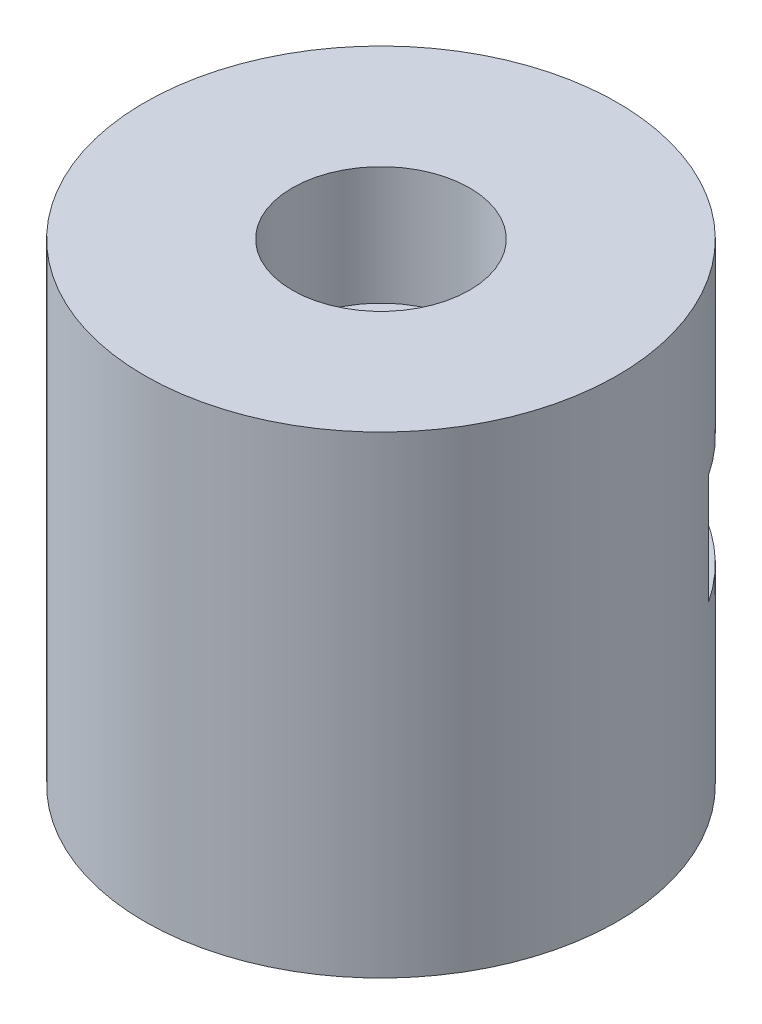
ISO-10303-21;
HEADER;
FILE_DESCRIPTION(('STEP AP214'),'2;1');
FILE_NAME('part.step','',(''),(''),'','','');
FILE_SCHEMA(('AUTOMOTIVE_DESIGN { 1 0 10303 214 1 1 1 1 }'));
ENDSEC;
DATA;
#1=APPLICATION_CONTEXT('core data for automotive mechanical design processes');
#2=APPLICATION_PROTOCOL_DEFINITION('international standard','automotive_design',2000,#1);
#3=PRODUCT_CONTEXT('',#1,'mechanical');
#4=PRODUCT('Part','Part','',(#3));
#5=PRODUCT_RELATED_PRODUCT_CATEGORY('part','',(#4));
#6=PRODUCT_DEFINITION_FORMATION('','',#4);
#7=PRODUCT_DEFINITION_CONTEXT('part definition',#1,'design');
#8=PRODUCT_DEFINITION('design','',#6,#7);
#9=PRODUCT_DEFINITION_SHAPE('','',#8);
#10=(LENGTH_UNIT() NAMED_UNIT(*) SI_UNIT(.MILLI.,.METRE.));
#11=(NAMED_UNIT(*) PLANE_ANGLE_UNIT() SI_UNIT($,.RADIAN.));
#12=(NAMED_UNIT(*) SI_UNIT($,.STERADIAN.) SOLID_ANGLE_UNIT());
#13=UNCERTAINTY_MEASURE_WITH_UNIT(LENGTH_MEASURE(1.E-05),#10,'distance_accuracy_value','');
#14=(GEOMETRIC_REPRESENTATION_CONTEXT(3) GLOBAL_UNCERTAINTY_ASSIGNED_CONTEXT((#13)) GLOBAL_UNIT_ASSIGNED_CONTEXT((#10,
#11,#12)) REPRESENTATION_CONTEXT('',''));
#15=CARTESIAN_POINT('',(0.,0.,0.));
#16=DIRECTION('',(0.,0.,1.));
#17=DIRECTION('',(1.,0.,0.));
#18=AXIS2_PLACEMENT_3D('',#15,#16,#17);
#19=CARTESIAN_POINT('',(0.,40.,0.));
#20=DIRECTION('',(0.,-1.,0.));
#21=DIRECTION('',(0.,0.,-1.));
#22=AXIS2_PLACEMENT_3D('',#19,#20,#21);
#23=CYLINDRICAL_SURFACE('',#22,20.);
#24=CARTESIAN_POINT('',(0.,40.,0.));
#25=DIRECTION('',(0.,1.,0.));
#26=DIRECTION('',(0.,0.,1.));
#27=AXIS2_PLACEMENT_3D('',#24,#25,#26);
#28=CIRCLE('',#27,20.);
#29=CARTESIAN_POINT('',(0.,40.,20.));
#30=VERTEX_POINT('',#29);
#31=EDGE_CURVE('E102',#30,#30,#28,.T.);
#32=ORIENTED_EDGE('',*,*,#31,.F.);
#33=EDGE_LOOP('',(#32));
#34=FACE_BOUND('',#33,.T.);
#35=CARTESIAN_POINT('',(0.,0.,0.));
#36=DIRECTION('',(0.,1.,0.));
#37=DIRECTION('',(0.,0.,1.));
#38=AXIS2_PLACEMENT_3D('',#35,#36,#37);
#39=CIRCLE('',#38,20.);
#40=CARTESIAN_POINT('',(0.,0.,20.));
#41=VERTEX_POINT('',#40);
#42=EDGE_CURVE('E100',#41,#41,#39,.T.);
#43=ORIENTED_EDGE('',*,*,#42,.T.);
#44=EDGE_LOOP('',(#43));
#45=FACE_BOUND('',#44,.T.);
#46=CARTESIAN_POINT('',(0.,16.2259243327284,0.));
#47=DIRECTION('',(0.,1.,0.));
#48=DIRECTION('',(0.,0.,1.));
#49=AXIS2_PLACEMENT_3D('',#46,#47,#48);
#50=CIRCLE('',#49,20.);
#51=CARTESIAN_POINT('',(16.7022923147358,16.2259243327284,-11.0015195056464));
#52=VERTEX_POINT('',#51);
#53=CARTESIAN_POINT('',(-16.7022923147358,16.2259243327284,-11.0015195056464));
#54=VERTEX_POINT('',#53);
#55=EDGE_CURVE('E56',#52,#54,#50,.T.);
#56=ORIENTED_EDGE('',*,*,#55,.F.);
#57=DIRECTION('',(0.,-1.,0.));
#58=VECTOR('',#57,1.);
#59=CARTESIAN_POINT('',(16.7022923147358,40.,-11.0015195056464));
#60=LINE('',#59,#58);
#61=CARTESIAN_POINT('',(16.7022923147358,25.5406642774849,-11.0015195056464));
#62=VERTEX_POINT('',#61);
#63=EDGE_CURVE('E11',#62,#52,#60,.T.);
#64=ORIENTED_EDGE('',*,*,#63,.F.);
#65=CARTESIAN_POINT('',(0.,25.5406642774849,0.));
#66=DIRECTION('',(0.,-1.,0.));
#67=DIRECTION('',(0.,0.,-1.));
#68=AXIS2_PLACEMENT_3D('',#65,#66,#67);
#69=CIRCLE('',#68,20.);
#70=CARTESIAN_POINT('',(-16.7022923147358,25.5406642774849,-11.0015195056464));
#71=VERTEX_POINT('',#70);
#72=EDGE_CURVE('E105',#71,#62,#69,.T.);
#73=ORIENTED_EDGE('',*,*,#72,.F.);
#74=DIRECTION('',(0.,-1.,0.));
#75=VECTOR('',#74,1.);
#76=CARTESIAN_POINT('',(-16.7022923147358,40.,-11.0015195056464));
#77=LINE('',#76,#75);
#78=EDGE_CURVE('E41',#54,#71,#77,.F.);
#79=ORIENTED_EDGE('',*,*,#78,.F.);
#80=EDGE_LOOP('',(#56,#64,#73,#79));
#81=FACE_BOUND('',#80,.T.);
#82=ADVANCED_FACE('F34',(#34,#45,#81),#23,.T.);
#83=CARTESIAN_POINT('',(0.,40.,0.));
#84=DIRECTION('',(0.,1.,0.));
#85=DIRECTION('',(0.,0.,1.));
#86=AXIS2_PLACEMENT_3D('',#83,#84,#85);
#87=PLANE('',#86);
#88=CARTESIAN_POINT('',(0.,40.,0.));
#89=DIRECTION('',(0.,1.,0.));
#90=DIRECTION('',(0.,0.,1.));
#91=AXIS2_PLACEMENT_3D('',#88,#89,#90);
#92=CIRCLE('',#91,7.5);
#93=CARTESIAN_POINT('',(0.,40.,7.5));
#94=VERTEX_POINT('',#93);
#95=EDGE_CURVE('E89',#94,#94,#92,.T.);
#96=ORIENTED_EDGE('',*,*,#95,.F.);
#97=EDGE_LOOP('',(#96));
#98=FACE_BOUND('',#97,.T.);
#99=ORIENTED_EDGE('',*,*,#31,.T.);
#100=EDGE_LOOP('',(#99));
#101=FACE_BOUND('',#100,.T.);
#102=ADVANCED_FACE('F130',(#98,#101),#87,.T.);
#103=CARTESIAN_POINT('',(0.,0.,0.));
#104=DIRECTION('',(0.,1.,0.));
#105=DIRECTION('',(0.,0.,1.));
#106=AXIS2_PLACEMENT_3D('',#103,#104,#105);
#107=PLANE('',#106);
#108=ORIENTED_EDGE('',*,*,#42,.F.);
#109=EDGE_LOOP('',(#108));
#110=FACE_BOUND('',#109,.T.);
#111=ADVANCED_FACE('F135',(#110),#107,.F.);
#112=CARTESIAN_POINT('',(0.,30.,0.));
#113=DIRECTION('',(0.,1.,0.));
#114=DIRECTION('',(0.,0.,1.));
#115=AXIS2_PLACEMENT_3D('',#112,#113,#114);
#116=CYLINDRICAL_SURFACE('',#115,7.5);
#117=CARTESIAN_POINT('',(0.,30.,0.));
#118=DIRECTION('',(0.,1.,0.));
#119=DIRECTION('',(0.,0.,1.));
#120=AXIS2_PLACEMENT_3D('',#117,#118,#119);
#121=CIRCLE('',#120,7.5);
#122=CARTESIAN_POINT('',(0.,30.,7.5));
#123=VERTEX_POINT('',#122);
#124=EDGE_CURVE('E93',#123,#123,#121,.T.);
#125=ORIENTED_EDGE('',*,*,#124,.F.);
#126=EDGE_LOOP('',(#125));
#127=FACE_BOUND('',#126,.T.);
#128=ORIENTED_EDGE('',*,*,#95,.T.);
#129=EDGE_LOOP('',(#128));
#130=FACE_BOUND('',#129,.T.);
#131=ADVANCED_FACE('F143',(#127,#130),#116,.F.);
#132=CARTESIAN_POINT('',(0.,30.,0.));
#133=DIRECTION('',(0.,1.,0.));
#134=DIRECTION('',(0.,0.,1.));
#135=AXIS2_PLACEMENT_3D('',#132,#133,#134);
#136=PLANE('',#135);
#137=ORIENTED_EDGE('',*,*,#124,.T.);
#138=EDGE_LOOP('',(#137));
#139=FACE_BOUND('',#138,.T.);
#140=ADVANCED_FACE('F147',(#139),#136,.T.);
#141=CARTESIAN_POINT('',(-16.7022923147358,25.5406642774849,-10.));
#142=DIRECTION('',(1.,0.,0.));
#143=DIRECTION('',(0.,0.,-1.));
#144=AXIS2_PLACEMENT_3D('',#141,#142,#143);
#145=PLANE('',#144);
#146=ORIENTED_EDGE('',*,*,#78,.T.);
#147=DIRECTION('',(0.,0.,-1.));
#148=VECTOR('',#147,1.);
#149=CARTESIAN_POINT('',(-16.7022923147358,25.5406642774849,-10.));
#150=LINE('',#149,#148);
#151=CARTESIAN_POINT('',(-16.7022923147358,25.5406642774849,-10.));
#152=VERTEX_POINT('',#151);
#153=EDGE_CURVE('E48',#152,#71,#150,.T.);
#154=ORIENTED_EDGE('',*,*,#153,.F.);
#155=DIRECTION('',(0.,-1.,0.));
#156=VECTOR('',#155,1.);
#157=CARTESIAN_POINT('',(-16.7022923147358,25.5406642774849,-10.));
#158=LINE('',#157,#156);
#159=CARTESIAN_POINT('',(-16.7022923147358,16.2259243327284,-10.));
#160=VERTEX_POINT('',#159);
#161=EDGE_CURVE('E79',#152,#160,#158,.T.);
#162=ORIENTED_EDGE('',*,*,#161,.T.);
#163=DIRECTION('',(0.,0.,-1.));
#164=VECTOR('',#163,1.);
#165=CARTESIAN_POINT('',(-16.7022923147358,16.2259243327284,-10.));
#166=LINE('',#165,#164);
#167=EDGE_CURVE('E85',#160,#54,#166,.T.);
#168=ORIENTED_EDGE('',*,*,#167,.T.);
#169=EDGE_LOOP('',(#146,#154,#162,#168));
#170=FACE_BOUND('',#169,.T.);
#171=ADVANCED_FACE('F84',(#170),#145,.T.);
#172=CARTESIAN_POINT('',(16.7022923147358,16.2259243327284,-10.));
#173=DIRECTION('',(0.,1.,0.));
#174=DIRECTION('',(0.,0.,1.));
#175=AXIS2_PLACEMENT_3D('',#172,#173,#174);
#176=PLANE('',#175);
#177=DIRECTION('',(0.,0.,-1.));
#178=VECTOR('',#177,1.);
#179=CARTESIAN_POINT('',(16.7022923147358,16.2259243327284,-10.));
#180=LINE('',#179,#178);
#181=CARTESIAN_POINT('',(16.7022923147358,16.2259243327284,-10.));
#182=VERTEX_POINT('',#181);
#183=EDGE_CURVE('E90',#182,#52,#180,.T.);
#184=ORIENTED_EDGE('',*,*,#183,.T.);
#185=ORIENTED_EDGE('',*,*,#55,.T.);
#186=ORIENTED_EDGE('',*,*,#167,.F.);
#187=DIRECTION('',(1.,0.,0.));
#188=VECTOR('',#187,1.);
#189=CARTESIAN_POINT('',(16.7022923147358,16.2259243327284,-10.));
#190=LINE('',#189,#188);
#191=EDGE_CURVE('E75',#160,#182,#190,.T.);
#192=ORIENTED_EDGE('',*,*,#191,.T.);
#193=EDGE_LOOP('',(#184,#185,#186,#192));
#194=FACE_BOUND('',#193,.T.);
#195=ADVANCED_FACE('F88',(#194),#176,.T.);
#196=CARTESIAN_POINT('',(16.7022923147358,25.5406642774849,-10.));
#197=DIRECTION('',(-1.,0.,0.));
#198=DIRECTION('',(0.,0.,1.));
#199=AXIS2_PLACEMENT_3D('',#196,#197,#198);
#200=PLANE('',#199);
#201=ORIENTED_EDGE('',*,*,#63,.T.);
#202=ORIENTED_EDGE('',*,*,#183,.F.);
#203=DIRECTION('',(0.,1.,0.));
#204=VECTOR('',#203,1.);
#205=CARTESIAN_POINT('',(16.7022923147358,25.5406642774849,-10.));
#206=LINE('',#205,#204);
#207=CARTESIAN_POINT('',(16.7022923147358,25.5406642774849,-10.));
#208=VERTEX_POINT('',#207);
#209=EDGE_CURVE('E80',#182,#208,#206,.T.);
#210=ORIENTED_EDGE('',*,*,#209,.T.);
#211=DIRECTION('',(0.,0.,-1.));
#212=VECTOR('',#211,1.);
#213=CARTESIAN_POINT('',(16.7022923147358,25.5406642774849,-10.));
#214=LINE('',#213,#212);
#215=EDGE_CURVE('E95',#208,#62,#214,.T.);
#216=ORIENTED_EDGE('',*,*,#215,.T.);
#217=EDGE_LOOP('',(#201,#202,#210,#216));
#218=FACE_BOUND('',#217,.T.);
#219=ADVANCED_FACE('F116',(#218),#200,.T.);
#220=CARTESIAN_POINT('',(16.7022923147358,25.5406642774849,-10.));
#221=DIRECTION('',(0.,-1.,0.));
#222=DIRECTION('',(0.,0.,-1.));
#223=AXIS2_PLACEMENT_3D('',#220,#221,#222);
#224=PLANE('',#223);
#225=ORIENTED_EDGE('',*,*,#72,.T.);
#226=ORIENTED_EDGE('',*,*,#215,.F.);
#227=DIRECTION('',(-1.,0.,0.));
#228=VECTOR('',#227,1.);
#229=CARTESIAN_POINT('',(16.7022923147358,25.5406642774849,-10.));
#230=LINE('',#229,#228);
#231=EDGE_CURVE('E117',#208,#152,#230,.T.);
#232=ORIENTED_EDGE('',*,*,#231,.T.);
#233=ORIENTED_EDGE('',*,*,#153,.T.);
#234=EDGE_LOOP('',(#225,#226,#232,#233));
#235=FACE_BOUND('',#234,.T.);
#236=ADVANCED_FACE('F114',(#235),#224,.T.);
#237=CARTESIAN_POINT('',(0.,0.,-10.));
#238=DIRECTION('',(0.,0.,-1.));
#239=DIRECTION('',(-1.,0.,0.));
#240=AXIS2_PLACEMENT_3D('',#237,#238,#239);
#241=PLANE('',#240);
#242=ORIENTED_EDGE('',*,*,#161,.F.);
#243=ORIENTED_EDGE('',*,*,#231,.F.);
#244=ORIENTED_EDGE('',*,*,#209,.F.);
#245=ORIENTED_EDGE('',*,*,#191,.F.);
#246=EDGE_LOOP('',(#242,#243,#244,#245));
#247=FACE_BOUND('',#246,.T.);
#248=ADVANCED_FACE('F77',(#247),#241,.T.);
#249=CLOSED_SHELL('',(#82,#102,#111,#131,#140,#171,#195,#219,#236,#248));
#250=MANIFOLD_SOLID_BREP('B2',#249);
#251=ADVANCED_BREP_SHAPE_REPRESENTATION('',(#18,#250),#14);
#252=SHAPE_DEFINITION_REPRESENTATION(#9,#251);
ENDSEC;
END-ISO-10303-21;
